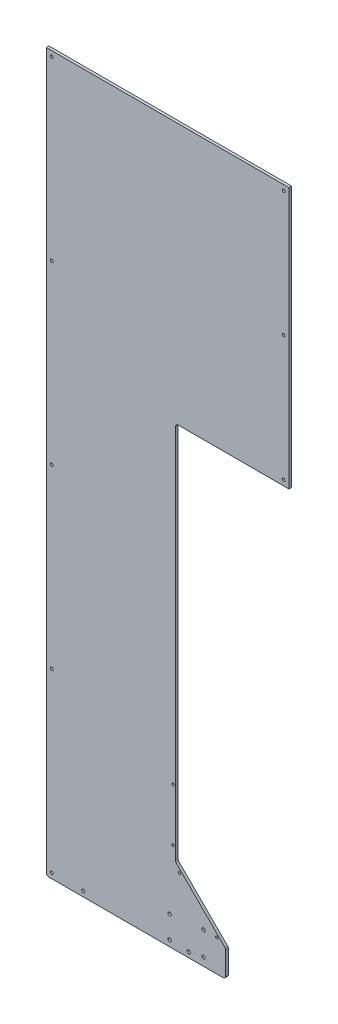
ISO-10303-21;
HEADER;
FILE_DESCRIPTION(('STEP AP214'),'2;1');
FILE_NAME('part.step','',(''),(''),'','','');
FILE_SCHEMA(('AUTOMOTIVE_DESIGN { 1 0 10303 214 1 1 1 1 }'));
ENDSEC;
DATA;
#1=APPLICATION_CONTEXT('core data for automotive mechanical design processes');
#2=APPLICATION_PROTOCOL_DEFINITION('international standard','automotive_design',2000,#1);
#3=PRODUCT_CONTEXT('',#1,'mechanical');
#4=PRODUCT('Part','Part','',(#3));
#5=PRODUCT_RELATED_PRODUCT_CATEGORY('part','',(#4));
#6=PRODUCT_DEFINITION_FORMATION('','',#4);
#7=PRODUCT_DEFINITION_CONTEXT('part definition',#1,'design');
#8=PRODUCT_DEFINITION('design','',#6,#7);
#9=PRODUCT_DEFINITION_SHAPE('','',#8);
#10=(LENGTH_UNIT() NAMED_UNIT(*) SI_UNIT(.MILLI.,.METRE.));
#11=(NAMED_UNIT(*) PLANE_ANGLE_UNIT() SI_UNIT($,.RADIAN.));
#12=(NAMED_UNIT(*) SI_UNIT($,.STERADIAN.) SOLID_ANGLE_UNIT());
#13=UNCERTAINTY_MEASURE_WITH_UNIT(LENGTH_MEASURE(1.E-05),#10,'distance_accuracy_value','');
#14=(GEOMETRIC_REPRESENTATION_CONTEXT(3) GLOBAL_UNCERTAINTY_ASSIGNED_CONTEXT((#13)) GLOBAL_UNIT_ASSIGNED_CONTEXT((#10,
#11,#12)) REPRESENTATION_CONTEXT('',''));
#15=CARTESIAN_POINT('',(0.,0.,0.));
#16=DIRECTION('',(0.,0.,1.));
#17=DIRECTION('',(1.,0.,0.));
#18=AXIS2_PLACEMENT_3D('',#15,#16,#17);
#19=CARTESIAN_POINT('',(0.,0.,6.35));
#20=DIRECTION('',(1.,0.,0.));
#21=DIRECTION('',(0.,0.,-1.));
#22=AXIS2_PLACEMENT_3D('',#19,#20,#21);
#23=PLANE('',#22);
#24=DIRECTION('',(0.,-1.,0.));
#25=VECTOR('',#24,1.);
#26=CARTESIAN_POINT('',(0.,0.,0.));
#27=LINE('',#26,#25);
#28=CARTESIAN_POINT('',(0.,1727.2,0.));
#29=VERTEX_POINT('',#28);
#30=CARTESIAN_POINT('',(0.,6.35,0.));
#31=VERTEX_POINT('',#30);
#32=EDGE_CURVE('E148',#29,#31,#27,.T.);
#33=ORIENTED_EDGE('',*,*,#32,.T.);
#34=DIRECTION('',(0.,0.,-1.));
#35=VECTOR('',#34,1.);
#36=CARTESIAN_POINT('',(0.,6.35,6.35));
#37=LINE('',#36,#35);
#38=CARTESIAN_POINT('',(0.,6.35,6.35));
#39=VERTEX_POINT('',#38);
#40=EDGE_CURVE('E182',#31,#39,#37,.F.);
#41=ORIENTED_EDGE('',*,*,#40,.T.);
#42=DIRECTION('',(0.,-1.,0.));
#43=VECTOR('',#42,1.);
#44=CARTESIAN_POINT('',(0.,0.,6.35));
#45=LINE('',#44,#43);
#46=CARTESIAN_POINT('',(0.,1727.2,6.35));
#47=VERTEX_POINT('',#46);
#48=EDGE_CURVE('E158',#47,#39,#45,.T.);
#49=ORIENTED_EDGE('',*,*,#48,.F.);
#50=DIRECTION('',(0.,0.,-1.));
#51=VECTOR('',#50,1.);
#52=CARTESIAN_POINT('',(0.,1727.2,6.35));
#53=LINE('',#52,#51);
#54=EDGE_CURVE('E164',#47,#29,#53,.T.);
#55=ORIENTED_EDGE('',*,*,#54,.T.);
#56=EDGE_LOOP('',(#33,#41,#49,#55));
#57=FACE_BOUND('',#56,.T.);
#58=ADVANCED_FACE('F35',(#57),#23,.F.);
#59=CARTESIAN_POINT('',(0.,0.,6.35));
#60=DIRECTION('',(0.,1.,0.));
#61=DIRECTION('',(0.,0.,1.));
#62=AXIS2_PLACEMENT_3D('',#59,#60,#61);
#63=PLANE('',#62);
#64=DIRECTION('',(1.,0.,0.));
#65=VECTOR('',#64,1.);
#66=CARTESIAN_POINT('',(0.,0.,6.35));
#67=LINE('',#66,#65);
#68=CARTESIAN_POINT('',(6.35,0.,6.35));
#69=VERTEX_POINT('',#68);
#70=CARTESIAN_POINT('',(425.45,0.,6.35));
#71=VERTEX_POINT('',#70);
#72=EDGE_CURVE('E292',#69,#71,#67,.T.);
#73=ORIENTED_EDGE('',*,*,#72,.F.);
#74=DIRECTION('',(0.,0.,-1.));
#75=VECTOR('',#74,1.);
#76=CARTESIAN_POINT('',(6.35,0.,6.35));
#77=LINE('',#76,#75);
#78=CARTESIAN_POINT('',(6.35,0.,0.));
#79=VERTEX_POINT('',#78);
#80=EDGE_CURVE('E173',#69,#79,#77,.T.);
#81=ORIENTED_EDGE('',*,*,#80,.T.);
#82=DIRECTION('',(1.,0.,0.));
#83=VECTOR('',#82,1.);
#84=CARTESIAN_POINT('',(0.,0.,0.));
#85=LINE('',#84,#83);
#86=CARTESIAN_POINT('',(425.45,0.,0.));
#87=VERTEX_POINT('',#86);
#88=EDGE_CURVE('E156',#79,#87,#85,.T.);
#89=ORIENTED_EDGE('',*,*,#88,.T.);
#90=DIRECTION('',(0.,0.,1.));
#91=VECTOR('',#90,1.);
#92=CARTESIAN_POINT('',(425.45,0.,6.35));
#93=LINE('',#92,#91);
#94=EDGE_CURVE('E170',#87,#71,#93,.T.);
#95=ORIENTED_EDGE('',*,*,#94,.T.);
#96=EDGE_LOOP('',(#73,#81,#89,#95));
#97=FACE_BOUND('',#96,.T.);
#98=ADVANCED_FACE('F308',(#97),#63,.F.);
#99=CARTESIAN_POINT('',(584.2,0.,6.35));
#100=DIRECTION('',(-1.,0.,0.));
#101=DIRECTION('',(0.,0.,1.));
#102=AXIS2_PLACEMENT_3D('',#99,#100,#101);
#103=PLANE('',#102);
#104=DIRECTION('',(0.,1.,0.));
#105=VECTOR('',#104,1.);
#106=CARTESIAN_POINT('',(584.2,0.,6.35));
#107=LINE('',#106,#105);
#108=CARTESIAN_POINT('',(584.2,1098.55,6.35));
#109=VERTEX_POINT('',#108);
#110=CARTESIAN_POINT('',(584.2,1727.2,6.35));
#111=VERTEX_POINT('',#110);
#112=EDGE_CURVE('E147',#109,#111,#107,.T.);
#113=ORIENTED_EDGE('',*,*,#112,.F.);
#114=DIRECTION('',(0.,0.,1.));
#115=VECTOR('',#114,1.);
#116=CARTESIAN_POINT('',(584.2,1098.55,0.));
#117=LINE('',#116,#115);
#118=CARTESIAN_POINT('',(584.2,1098.55,0.));
#119=VERTEX_POINT('',#118);
#120=EDGE_CURVE('E132',#119,#109,#117,.T.);
#121=ORIENTED_EDGE('',*,*,#120,.F.);
#122=DIRECTION('',(0.,1.,0.));
#123=VECTOR('',#122,1.);
#124=CARTESIAN_POINT('',(584.2,0.,0.));
#125=LINE('',#124,#123);
#126=CARTESIAN_POINT('',(584.2,1727.2,0.));
#127=VERTEX_POINT('',#126);
#128=EDGE_CURVE('E145',#119,#127,#125,.T.);
#129=ORIENTED_EDGE('',*,*,#128,.T.);
#130=DIRECTION('',(0.,0.,-1.));
#131=VECTOR('',#130,1.);
#132=CARTESIAN_POINT('',(584.2,1727.2,6.35));
#133=LINE('',#132,#131);
#134=EDGE_CURVE('E167',#111,#127,#133,.T.);
#135=ORIENTED_EDGE('',*,*,#134,.F.);
#136=EDGE_LOOP('',(#113,#121,#129,#135));
#137=FACE_BOUND('',#136,.T.);
#138=ADVANCED_FACE('F143',(#137),#103,.F.);
#139=CARTESIAN_POINT('',(0.,1727.2,6.35));
#140=DIRECTION('',(0.,-1.,0.));
#141=DIRECTION('',(0.,0.,-1.));
#142=AXIS2_PLACEMENT_3D('',#139,#140,#141);
#143=PLANE('',#142);
#144=DIRECTION('',(-1.,0.,0.));
#145=VECTOR('',#144,1.);
#146=CARTESIAN_POINT('',(0.,1727.2,0.));
#147=LINE('',#146,#145);
#148=EDGE_CURVE('E155',#127,#29,#147,.T.);
#149=ORIENTED_EDGE('',*,*,#148,.T.);
#150=ORIENTED_EDGE('',*,*,#54,.F.);
#151=DIRECTION('',(-1.,0.,0.));
#152=VECTOR('',#151,1.);
#153=CARTESIAN_POINT('',(0.,1727.2,6.35));
#154=LINE('',#153,#152);
#155=EDGE_CURVE('E168',#111,#47,#154,.T.);
#156=ORIENTED_EDGE('',*,*,#155,.F.);
#157=ORIENTED_EDGE('',*,*,#134,.T.);
#158=EDGE_LOOP('',(#149,#150,#156,#157));
#159=FACE_BOUND('',#158,.T.);
#160=ADVANCED_FACE('F497',(#159),#143,.F.);
#161=CARTESIAN_POINT('',(0.,0.,6.35));
#162=DIRECTION('',(0.,0.,-1.));
#163=DIRECTION('',(-1.,0.,0.));
#164=AXIS2_PLACEMENT_3D('',#161,#162,#163);
#165=PLANE('',#164);
#166=CARTESIAN_POINT('',(296.8625,68.2625,6.35));
#167=DIRECTION('',(0.,0.,-1.));
#168=DIRECTION('',(-1.,0.,0.));
#169=AXIS2_PLACEMENT_3D('',#166,#167,#168);
#170=CIRCLE('',#169,3.96875000000002);
#171=CARTESIAN_POINT('',(292.89375,68.2625,6.35));
#172=VERTEX_POINT('',#171);
#173=EDGE_CURVE('E721',#172,#172,#170,.T.);
#174=ORIENTED_EDGE('',*,*,#173,.T.);
#175=EDGE_LOOP('',(#174));
#176=FACE_BOUND('',#175,.T.);
#177=CARTESIAN_POINT('',(296.8625,14.2875,6.35));
#178=DIRECTION('',(0.,0.,-1.));
#179=DIRECTION('',(-1.,0.,0.));
#180=AXIS2_PLACEMENT_3D('',#177,#178,#179);
#181=CIRCLE('',#180,3.96875000000002);
#182=CARTESIAN_POINT('',(292.89375,14.2875,6.35));
#183=VERTEX_POINT('',#182);
#184=EDGE_CURVE('E731',#183,#183,#181,.T.);
#185=ORIENTED_EDGE('',*,*,#184,.T.);
#186=EDGE_LOOP('',(#185));
#187=FACE_BOUND('',#186,.T.);
#188=CARTESIAN_POINT('',(378.46762,19.0499999999997,6.35));
#189=DIRECTION('',(0.,0.,1.));
#190=DIRECTION('',(1.,0.,0.));
#191=AXIS2_PLACEMENT_3D('',#188,#189,#190);
#192=CIRCLE('',#191,3.937);
#193=CARTESIAN_POINT('',(382.40462,19.0499999999997,6.35));
#194=VERTEX_POINT('',#193);
#195=EDGE_CURVE('E739',#194,#194,#192,.T.);
#196=ORIENTED_EDGE('',*,*,#195,.F.);
#197=EDGE_LOOP('',(#196));
#198=FACE_BOUND('',#197,.T.);
#199=CARTESIAN_POINT('',(378.46762,76.1999999999997,6.35));
#200=DIRECTION('',(0.,0.,1.));
#201=DIRECTION('',(1.,0.,0.));
#202=AXIS2_PLACEMENT_3D('',#199,#200,#201);
#203=CIRCLE('',#202,3.937);
#204=CARTESIAN_POINT('',(382.40462,76.1999999999997,6.35));
#205=VERTEX_POINT('',#204);
#206=EDGE_CURVE('E734',#205,#205,#203,.T.);
#207=ORIENTED_EDGE('',*,*,#206,.F.);
#208=EDGE_LOOP('',(#207));
#209=FACE_BOUND('',#208,.T.);
#210=CARTESIAN_POINT('',(304.8,342.9,6.35));
#211=DIRECTION('',(0.,0.,-1.));
#212=DIRECTION('',(-1.,0.,0.));
#213=AXIS2_PLACEMENT_3D('',#210,#211,#212);
#214=CIRCLE('',#213,2.8067);
#215=CARTESIAN_POINT('',(301.9933,342.9,6.35));
#216=VERTEX_POINT('',#215);
#217=EDGE_CURVE('E752',#216,#216,#214,.T.);
#218=ORIENTED_EDGE('',*,*,#217,.T.);
#219=EDGE_LOOP('',(#218));
#220=FACE_BOUND('',#219,.T.);
#221=CARTESIAN_POINT('',(304.8,215.9,6.35));
#222=DIRECTION('',(0.,0.,-1.));
#223=DIRECTION('',(-1.,0.,0.));
#224=AXIS2_PLACEMENT_3D('',#221,#222,#223);
#225=CIRCLE('',#224,2.8067);
#226=CARTESIAN_POINT('',(301.9933,215.9,6.35));
#227=VERTEX_POINT('',#226);
#228=EDGE_CURVE('E761',#227,#227,#225,.T.);
#229=ORIENTED_EDGE('',*,*,#228,.T.);
#230=EDGE_LOOP('',(#229));
#231=FACE_BOUND('',#230,.T.);
#232=CARTESIAN_POINT('',(320.317182668239,166.002561210692,6.35));
#233=DIRECTION('',(0.,0.,-1.));
#234=DIRECTION('',(-1.,0.,0.));
#235=AXIS2_PLACEMENT_3D('',#232,#233,#234);
#236=CIRCLE('',#235,2.8067);
#237=CARTESIAN_POINT('',(317.510482668239,166.002561210692,6.35));
#238=VERTEX_POINT('',#237);
#239=EDGE_CURVE('E770',#238,#238,#236,.T.);
#240=ORIENTED_EDGE('',*,*,#239,.T.);
#241=EDGE_LOOP('',(#240));
#242=FACE_BOUND('',#241,.T.);
#243=CARTESIAN_POINT('',(410.11974387893,76.2,6.35));
#244=DIRECTION('',(0.,0.,-1.));
#245=DIRECTION('',(-1.,0.,0.));
#246=AXIS2_PLACEMENT_3D('',#243,#244,#245);
#247=CIRCLE('',#246,2.8067);
#248=CARTESIAN_POINT('',(407.31304387893,76.2,6.35));
#249=VERTEX_POINT('',#248);
#250=EDGE_CURVE('E222',#249,#249,#247,.T.);
#251=ORIENTED_EDGE('',*,*,#250,.T.);
#252=EDGE_LOOP('',(#251));
#253=FACE_BOUND('',#252,.T.);
#254=CARTESIAN_POINT('',(88.9,12.7,6.35));
#255=DIRECTION('',(0.,0.,1.));
#256=DIRECTION('',(1.,0.,0.));
#257=AXIS2_PLACEMENT_3D('',#254,#255,#256);
#258=CIRCLE('',#257,3.96875);
#259=CARTESIAN_POINT('',(92.86875,12.7,6.35));
#260=VERTEX_POINT('',#259);
#261=EDGE_CURVE('E211',#260,#260,#258,.T.);
#262=ORIENTED_EDGE('',*,*,#261,.F.);
#263=EDGE_LOOP('',(#262));
#264=FACE_BOUND('',#263,.T.);
#265=CARTESIAN_POINT('',(342.9,12.7,6.35));
#266=DIRECTION('',(0.,0.,1.));
#267=DIRECTION('',(1.,0.,0.));
#268=AXIS2_PLACEMENT_3D('',#265,#266,#267);
#269=CIRCLE('',#268,3.96875000000005);
#270=CARTESIAN_POINT('',(346.86875,12.7,6.35));
#271=VERTEX_POINT('',#270);
#272=EDGE_CURVE('E217',#271,#271,#269,.T.);
#273=ORIENTED_EDGE('',*,*,#272,.F.);
#274=EDGE_LOOP('',(#273));
#275=FACE_BOUND('',#274,.T.);
#276=CARTESIAN_POINT('',(12.7,1714.5,6.35));
#277=DIRECTION('',(0.,0.,1.));
#278=DIRECTION('',(1.,0.,0.));
#279=AXIS2_PLACEMENT_3D('',#276,#277,#278);
#280=CIRCLE('',#279,3.37819999999999);
#281=CARTESIAN_POINT('',(16.0782,1714.5,6.35));
#282=VERTEX_POINT('',#281);
#283=EDGE_CURVE('E215',#282,#282,#280,.T.);
#284=ORIENTED_EDGE('',*,*,#283,.F.);
#285=EDGE_LOOP('',(#284));
#286=FACE_BOUND('',#285,.T.);
#287=CARTESIAN_POINT('',(12.7,1289.05,6.35));
#288=DIRECTION('',(0.,0.,1.));
#289=DIRECTION('',(1.,0.,0.));
#290=AXIS2_PLACEMENT_3D('',#287,#288,#289);
#291=CIRCLE('',#290,3.37819999999999);
#292=CARTESIAN_POINT('',(16.0782,1289.05,6.35));
#293=VERTEX_POINT('',#292);
#294=EDGE_CURVE('E232',#293,#293,#291,.T.);
#295=ORIENTED_EDGE('',*,*,#294,.F.);
#296=EDGE_LOOP('',(#295));
#297=FACE_BOUND('',#296,.T.);
#298=CARTESIAN_POINT('',(12.7,863.6,6.35));
#299=DIRECTION('',(0.,0.,1.));
#300=DIRECTION('',(1.,0.,0.));
#301=AXIS2_PLACEMENT_3D('',#298,#299,#300);
#302=CIRCLE('',#301,3.37819999999999);
#303=CARTESIAN_POINT('',(16.0782,863.6,6.35));
#304=VERTEX_POINT('',#303);
#305=EDGE_CURVE('E238',#304,#304,#302,.T.);
#306=ORIENTED_EDGE('',*,*,#305,.F.);
#307=EDGE_LOOP('',(#306));
#308=FACE_BOUND('',#307,.T.);
#309=CARTESIAN_POINT('',(12.7,438.15,6.35));
#310=DIRECTION('',(0.,0.,1.));
#311=DIRECTION('',(1.,0.,0.));
#312=AXIS2_PLACEMENT_3D('',#309,#310,#311);
#313=CIRCLE('',#312,3.37819999999999);
#314=CARTESIAN_POINT('',(16.0782,438.15,6.35));
#315=VERTEX_POINT('',#314);
#316=EDGE_CURVE('E244',#315,#315,#313,.T.);
#317=ORIENTED_EDGE('',*,*,#316,.F.);
#318=EDGE_LOOP('',(#317));
#319=FACE_BOUND('',#318,.T.);
#320=CARTESIAN_POINT('',(12.7,12.7,6.35));
#321=DIRECTION('',(0.,0.,1.));
#322=DIRECTION('',(1.,0.,0.));
#323=AXIS2_PLACEMENT_3D('',#320,#321,#322);
#324=CIRCLE('',#323,3.37819999999999);
#325=CARTESIAN_POINT('',(16.0782,12.7,6.35));
#326=VERTEX_POINT('',#325);
#327=EDGE_CURVE('E250',#326,#326,#324,.T.);
#328=ORIENTED_EDGE('',*,*,#327,.F.);
#329=EDGE_LOOP('',(#328));
#330=FACE_BOUND('',#329,.T.);
#331=CARTESIAN_POINT('',(571.5,1111.25,6.35));
#332=DIRECTION('',(0.,0.,1.));
#333=DIRECTION('',(1.,0.,0.));
#334=AXIS2_PLACEMENT_3D('',#331,#332,#333);
#335=CIRCLE('',#334,3.3782);
#336=CARTESIAN_POINT('',(574.8782,1111.25,6.35));
#337=VERTEX_POINT('',#336);
#338=EDGE_CURVE('E256',#337,#337,#335,.T.);
#339=ORIENTED_EDGE('',*,*,#338,.F.);
#340=EDGE_LOOP('',(#339));
#341=FACE_BOUND('',#340,.T.);
#342=CARTESIAN_POINT('',(571.5,1412.875,6.35));
#343=DIRECTION('',(0.,0.,1.));
#344=DIRECTION('',(1.,0.,0.));
#345=AXIS2_PLACEMENT_3D('',#342,#343,#344);
#346=CIRCLE('',#345,3.3782);
#347=CARTESIAN_POINT('',(574.8782,1412.875,6.35));
#348=VERTEX_POINT('',#347);
#349=EDGE_CURVE('E262',#348,#348,#346,.T.);
#350=ORIENTED_EDGE('',*,*,#349,.F.);
#351=EDGE_LOOP('',(#350));
#352=FACE_BOUND('',#351,.T.);
#353=CARTESIAN_POINT('',(571.5,1714.5,6.35));
#354=DIRECTION('',(0.,0.,1.));
#355=DIRECTION('',(1.,0.,0.));
#356=AXIS2_PLACEMENT_3D('',#353,#354,#355);
#357=CIRCLE('',#356,3.3782);
#358=CARTESIAN_POINT('',(574.8782,1714.5,6.35));
#359=VERTEX_POINT('',#358);
#360=EDGE_CURVE('E268',#359,#359,#357,.T.);
#361=ORIENTED_EDGE('',*,*,#360,.F.);
#362=EDGE_LOOP('',(#361));
#363=FACE_BOUND('',#362,.T.);
#364=ORIENTED_EDGE('',*,*,#48,.T.);
#365=CARTESIAN_POINT('',(6.35,6.35,6.35));
#366=DIRECTION('',(0.,0.,-1.));
#367=DIRECTION('',(-1.,0.,0.));
#368=AXIS2_PLACEMENT_3D('',#365,#366,#367);
#369=CIRCLE('',#368,6.35);
#370=EDGE_CURVE('E188',#39,#69,#369,.F.);
#371=ORIENTED_EDGE('',*,*,#370,.T.);
#372=ORIENTED_EDGE('',*,*,#72,.T.);
#373=CARTESIAN_POINT('',(425.45,6.35,6.35));
#374=DIRECTION('',(0.,0.,-1.));
#375=DIRECTION('',(-1.,0.,0.));
#376=AXIS2_PLACEMENT_3D('',#373,#374,#375);
#377=CIRCLE('',#376,6.35);
#378=CARTESIAN_POINT('',(431.8,6.35,6.35));
#379=VERTEX_POINT('',#378);
#380=EDGE_CURVE('E186',#71,#379,#377,.F.);
#381=ORIENTED_EDGE('',*,*,#380,.T.);
#382=DIRECTION('',(0.,-1.,0.));
#383=VECTOR('',#382,1.);
#384=CARTESIAN_POINT('',(431.8,63.5,6.35));
#385=LINE('',#384,#383);
#386=CARTESIAN_POINT('',(431.8,60.8697438789308,6.35));
#387=VERTEX_POINT('',#386);
#388=EDGE_CURVE('E139',#387,#379,#385,.T.);
#389=ORIENTED_EDGE('',*,*,#388,.F.);
#390=CARTESIAN_POINT('',(425.45,60.8697438789308,6.35));
#391=DIRECTION('',(0.,0.,-1.));
#392=DIRECTION('',(-1.,0.,0.));
#393=AXIS2_PLACEMENT_3D('',#390,#391,#392);
#394=CIRCLE('',#393,6.35);
#395=CARTESIAN_POINT('',(429.940128060535,65.3598719394654,6.35));
#396=VERTEX_POINT('',#395);
#397=EDGE_CURVE('E184',#387,#396,#394,.F.);
#398=ORIENTED_EDGE('',*,*,#397,.T.);
#399=DIRECTION('',(0.70710678118655,-0.707106781186545,0.));
#400=VECTOR('',#399,1.);
#401=CARTESIAN_POINT('',(311.15,184.149999999999,6.35));
#402=LINE('',#401,#400);
#403=CARTESIAN_POINT('',(313.009871939466,182.290128060534,6.35));
#404=VERTEX_POINT('',#403);
#405=EDGE_CURVE('E285',#404,#396,#402,.T.);
#406=ORIENTED_EDGE('',*,*,#405,.F.);
#407=CARTESIAN_POINT('',(317.5,186.780256121068,6.35));
#408=DIRECTION('',(0.,0.,-1.));
#409=DIRECTION('',(-1.,0.,0.));
#410=AXIS2_PLACEMENT_3D('',#407,#408,#409);
#411=CIRCLE('',#410,6.35);
#412=CARTESIAN_POINT('',(311.15,186.780256121068,6.35));
#413=VERTEX_POINT('',#412);
#414=EDGE_CURVE('E57',#404,#413,#411,.T.);
#415=ORIENTED_EDGE('',*,*,#414,.T.);
#416=DIRECTION('',(0.,-1.,0.));
#417=VECTOR('',#416,1.);
#418=CARTESIAN_POINT('',(311.15,1098.55,6.35));
#419=LINE('',#418,#417);
#420=CARTESIAN_POINT('',(311.15,1092.2,6.35));
#421=VERTEX_POINT('',#420);
#422=EDGE_CURVE('E283',#421,#413,#419,.T.);
#423=ORIENTED_EDGE('',*,*,#422,.F.);
#424=CARTESIAN_POINT('',(317.5,1092.2,6.35));
#425=DIRECTION('',(0.,0.,-1.));
#426=DIRECTION('',(-1.,0.,0.));
#427=AXIS2_PLACEMENT_3D('',#424,#425,#426);
#428=CIRCLE('',#427,6.35);
#429=CARTESIAN_POINT('',(317.5,1098.55,6.35));
#430=VERTEX_POINT('',#429);
#431=EDGE_CURVE('E44',#421,#430,#428,.T.);
#432=ORIENTED_EDGE('',*,*,#431,.T.);
#433=DIRECTION('',(-1.,0.,0.));
#434=VECTOR('',#433,1.);
#435=CARTESIAN_POINT('',(584.2,1098.55,6.35));
#436=LINE('',#435,#434);
#437=EDGE_CURVE('E273',#109,#430,#436,.T.);
#438=ORIENTED_EDGE('',*,*,#437,.F.);
#439=ORIENTED_EDGE('',*,*,#112,.T.);
#440=ORIENTED_EDGE('',*,*,#155,.T.);
#441=EDGE_LOOP('',(#364,#371,#372,#381,#389,#398,#406,#415,#423,#432,#438,#439,#440));
#442=FACE_BOUND('',#441,.T.);
#443=ADVANCED_FACE('F306',(#176,#187,#198,#209,#220,#231,#242,#253,#264,#275,#286,#297,#308,
#319,#330,#341,#352,#363,#442),#165,.F.);
#444=CARTESIAN_POINT('',(0.,0.,0.));
#445=DIRECTION('',(0.,0.,-1.));
#446=DIRECTION('',(-1.,0.,0.));
#447=AXIS2_PLACEMENT_3D('',#444,#445,#446);
#448=PLANE('',#447);
#449=CARTESIAN_POINT('',(296.8625,68.2625,0.));
#450=DIRECTION('',(0.,0.,-1.));
#451=DIRECTION('',(-1.,0.,0.));
#452=AXIS2_PLACEMENT_3D('',#449,#450,#451);
#453=CIRCLE('',#452,3.96875000000002);
#454=CARTESIAN_POINT('',(292.89375,68.2625,0.));
#455=VERTEX_POINT('',#454);
#456=EDGE_CURVE('E724',#455,#455,#453,.T.);
#457=ORIENTED_EDGE('',*,*,#456,.F.);
#458=EDGE_LOOP('',(#457));
#459=FACE_BOUND('',#458,.T.);
#460=CARTESIAN_POINT('',(296.8625,14.2875,0.));
#461=DIRECTION('',(0.,0.,-1.));
#462=DIRECTION('',(-1.,0.,0.));
#463=AXIS2_PLACEMENT_3D('',#460,#461,#462);
#464=CIRCLE('',#463,3.96875000000002);
#465=CARTESIAN_POINT('',(292.89375,14.2875,0.));
#466=VERTEX_POINT('',#465);
#467=EDGE_CURVE('E726',#466,#466,#464,.T.);
#468=ORIENTED_EDGE('',*,*,#467,.F.);
#469=EDGE_LOOP('',(#468));
#470=FACE_BOUND('',#469,.T.);
#471=CARTESIAN_POINT('',(378.46762,19.0499999999997,0.));
#472=DIRECTION('',(0.,0.,1.));
#473=DIRECTION('',(1.,0.,0.));
#474=AXIS2_PLACEMENT_3D('',#471,#472,#473);
#475=CIRCLE('',#474,3.937);
#476=CARTESIAN_POINT('',(382.40462,19.0499999999997,0.));
#477=VERTEX_POINT('',#476);
#478=EDGE_CURVE('E735',#477,#477,#475,.T.);
#479=ORIENTED_EDGE('',*,*,#478,.T.);
#480=EDGE_LOOP('',(#479));
#481=FACE_BOUND('',#480,.T.);
#482=CARTESIAN_POINT('',(378.46762,76.1999999999997,0.));
#483=DIRECTION('',(0.,0.,1.));
#484=DIRECTION('',(1.,0.,0.));
#485=AXIS2_PLACEMENT_3D('',#482,#483,#484);
#486=CIRCLE('',#485,3.937);
#487=CARTESIAN_POINT('',(382.40462,76.1999999999997,0.));
#488=VERTEX_POINT('',#487);
#489=EDGE_CURVE('E742',#488,#488,#486,.T.);
#490=ORIENTED_EDGE('',*,*,#489,.T.);
#491=EDGE_LOOP('',(#490));
#492=FACE_BOUND('',#491,.T.);
#493=CARTESIAN_POINT('',(304.8,342.9,0.));
#494=DIRECTION('',(0.,0.,-1.));
#495=DIRECTION('',(-1.,0.,0.));
#496=AXIS2_PLACEMENT_3D('',#493,#494,#495);
#497=CIRCLE('',#496,4.88949999999999);
#498=CARTESIAN_POINT('',(299.9105,342.9,0.));
#499=VERTEX_POINT('',#498);
#500=EDGE_CURVE('E738',#499,#499,#497,.T.);
#501=ORIENTED_EDGE('',*,*,#500,.F.);
#502=EDGE_LOOP('',(#501));
#503=FACE_BOUND('',#502,.T.);
#504=CARTESIAN_POINT('',(304.8,215.9,0.));
#505=DIRECTION('',(0.,0.,-1.));
#506=DIRECTION('',(-1.,0.,0.));
#507=AXIS2_PLACEMENT_3D('',#504,#505,#506);
#508=CIRCLE('',#507,4.88949999999999);
#509=CARTESIAN_POINT('',(299.9105,215.9,0.));
#510=VERTEX_POINT('',#509);
#511=EDGE_CURVE('E755',#510,#510,#508,.T.);
#512=ORIENTED_EDGE('',*,*,#511,.F.);
#513=EDGE_LOOP('',(#512));
#514=FACE_BOUND('',#513,.T.);
#515=CARTESIAN_POINT('',(320.317182668239,166.002561210692,0.));
#516=DIRECTION('',(0.,0.,-1.));
#517=DIRECTION('',(-1.,0.,0.));
#518=AXIS2_PLACEMENT_3D('',#515,#516,#517);
#519=CIRCLE('',#518,4.88949999999999);
#520=CARTESIAN_POINT('',(315.427682668239,166.002561210692,0.));
#521=VERTEX_POINT('',#520);
#522=EDGE_CURVE('E764',#521,#521,#519,.T.);
#523=ORIENTED_EDGE('',*,*,#522,.F.);
#524=EDGE_LOOP('',(#523));
#525=FACE_BOUND('',#524,.T.);
#526=CARTESIAN_POINT('',(410.11974387893,76.2,0.));
#527=DIRECTION('',(0.,0.,-1.));
#528=DIRECTION('',(-1.,0.,0.));
#529=AXIS2_PLACEMENT_3D('',#526,#527,#528);
#530=CIRCLE('',#529,4.88949999999999);
#531=CARTESIAN_POINT('',(405.23024387893,76.2,0.));
#532=VERTEX_POINT('',#531);
#533=EDGE_CURVE('E773',#532,#532,#530,.T.);
#534=ORIENTED_EDGE('',*,*,#533,.F.);
#535=EDGE_LOOP('',(#534));
#536=FACE_BOUND('',#535,.T.);
#537=CARTESIAN_POINT('',(88.9,12.7,0.));
#538=DIRECTION('',(0.,0.,-1.));
#539=DIRECTION('',(-1.,0.,0.));
#540=AXIS2_PLACEMENT_3D('',#537,#538,#539);
#541=CIRCLE('',#540,3.96875);
#542=CARTESIAN_POINT('',(84.93125,12.7,0.));
#543=VERTEX_POINT('',#542);
#544=EDGE_CURVE('E39',#543,#543,#541,.T.);
#545=ORIENTED_EDGE('',*,*,#544,.F.);
#546=EDGE_LOOP('',(#545));
#547=FACE_BOUND('',#546,.T.);
#548=CARTESIAN_POINT('',(342.9,12.7,0.));
#549=DIRECTION('',(0.,0.,-1.));
#550=DIRECTION('',(-1.,0.,0.));
#551=AXIS2_PLACEMENT_3D('',#548,#549,#550);
#552=CIRCLE('',#551,3.96875000000005);
#553=CARTESIAN_POINT('',(338.93125,12.7,0.));
#554=VERTEX_POINT('',#553);
#555=EDGE_CURVE('E209',#554,#554,#552,.T.);
#556=ORIENTED_EDGE('',*,*,#555,.F.);
#557=EDGE_LOOP('',(#556));
#558=FACE_BOUND('',#557,.T.);
#559=CARTESIAN_POINT('',(12.7,1714.5,0.));
#560=DIRECTION('',(0.,0.,1.));
#561=DIRECTION('',(1.,0.,0.));
#562=AXIS2_PLACEMENT_3D('',#559,#560,#561);
#563=CIRCLE('',#562,3.37819999999999);
#564=CARTESIAN_POINT('',(16.0782,1714.5,0.));
#565=VERTEX_POINT('',#564);
#566=EDGE_CURVE('E229',#565,#565,#563,.T.);
#567=ORIENTED_EDGE('',*,*,#566,.T.);
#568=EDGE_LOOP('',(#567));
#569=FACE_BOUND('',#568,.T.);
#570=CARTESIAN_POINT('',(12.7,1289.05,0.));
#571=DIRECTION('',(0.,0.,1.));
#572=DIRECTION('',(1.,0.,0.));
#573=AXIS2_PLACEMENT_3D('',#570,#571,#572);
#574=CIRCLE('',#573,3.37819999999999);
#575=CARTESIAN_POINT('',(16.0782,1289.05,0.));
#576=VERTEX_POINT('',#575);
#577=EDGE_CURVE('E235',#576,#576,#574,.T.);
#578=ORIENTED_EDGE('',*,*,#577,.T.);
#579=EDGE_LOOP('',(#578));
#580=FACE_BOUND('',#579,.T.);
#581=CARTESIAN_POINT('',(12.7,863.6,0.));
#582=DIRECTION('',(0.,0.,1.));
#583=DIRECTION('',(1.,0.,0.));
#584=AXIS2_PLACEMENT_3D('',#581,#582,#583);
#585=CIRCLE('',#584,3.37819999999999);
#586=CARTESIAN_POINT('',(16.0782,863.6,0.));
#587=VERTEX_POINT('',#586);
#588=EDGE_CURVE('E241',#587,#587,#585,.T.);
#589=ORIENTED_EDGE('',*,*,#588,.T.);
#590=EDGE_LOOP('',(#589));
#591=FACE_BOUND('',#590,.T.);
#592=CARTESIAN_POINT('',(12.7,438.15,0.));
#593=DIRECTION('',(0.,0.,1.));
#594=DIRECTION('',(1.,0.,0.));
#595=AXIS2_PLACEMENT_3D('',#592,#593,#594);
#596=CIRCLE('',#595,3.37819999999999);
#597=CARTESIAN_POINT('',(16.0782,438.15,0.));
#598=VERTEX_POINT('',#597);
#599=EDGE_CURVE('E247',#598,#598,#596,.T.);
#600=ORIENTED_EDGE('',*,*,#599,.T.);
#601=EDGE_LOOP('',(#600));
#602=FACE_BOUND('',#601,.T.);
#603=CARTESIAN_POINT('',(12.7,12.7,0.));
#604=DIRECTION('',(0.,0.,1.));
#605=DIRECTION('',(1.,0.,0.));
#606=AXIS2_PLACEMENT_3D('',#603,#604,#605);
#607=CIRCLE('',#606,3.37819999999999);
#608=CARTESIAN_POINT('',(16.0782,12.7,0.));
#609=VERTEX_POINT('',#608);
#610=EDGE_CURVE('E253',#609,#609,#607,.T.);
#611=ORIENTED_EDGE('',*,*,#610,.T.);
#612=EDGE_LOOP('',(#611));
#613=FACE_BOUND('',#612,.T.);
#614=CARTESIAN_POINT('',(571.5,1111.25,0.));
#615=DIRECTION('',(0.,0.,1.));
#616=DIRECTION('',(1.,0.,0.));
#617=AXIS2_PLACEMENT_3D('',#614,#615,#616);
#618=CIRCLE('',#617,3.3782);
#619=CARTESIAN_POINT('',(574.8782,1111.25,0.));
#620=VERTEX_POINT('',#619);
#621=EDGE_CURVE('E259',#620,#620,#618,.T.);
#622=ORIENTED_EDGE('',*,*,#621,.T.);
#623=EDGE_LOOP('',(#622));
#624=FACE_BOUND('',#623,.T.);
#625=CARTESIAN_POINT('',(571.5,1412.875,0.));
#626=DIRECTION('',(0.,0.,1.));
#627=DIRECTION('',(1.,0.,0.));
#628=AXIS2_PLACEMENT_3D('',#625,#626,#627);
#629=CIRCLE('',#628,3.3782);
#630=CARTESIAN_POINT('',(574.8782,1412.875,0.));
#631=VERTEX_POINT('',#630);
#632=EDGE_CURVE('E265',#631,#631,#629,.T.);
#633=ORIENTED_EDGE('',*,*,#632,.T.);
#634=EDGE_LOOP('',(#633));
#635=FACE_BOUND('',#634,.T.);
#636=CARTESIAN_POINT('',(571.5,1714.5,0.));
#637=DIRECTION('',(0.,0.,1.));
#638=DIRECTION('',(1.,0.,0.));
#639=AXIS2_PLACEMENT_3D('',#636,#637,#638);
#640=CIRCLE('',#639,3.3782);
#641=CARTESIAN_POINT('',(574.8782,1714.5,0.));
#642=VERTEX_POINT('',#641);
#643=EDGE_CURVE('E271',#642,#642,#640,.T.);
#644=ORIENTED_EDGE('',*,*,#643,.T.);
#645=EDGE_LOOP('',(#644));
#646=FACE_BOUND('',#645,.T.);
#647=ORIENTED_EDGE('',*,*,#88,.F.);
#648=CARTESIAN_POINT('',(6.35,6.35,0.));
#649=DIRECTION('',(0.,0.,-1.));
#650=DIRECTION('',(-1.,0.,0.));
#651=AXIS2_PLACEMENT_3D('',#648,#649,#650);
#652=CIRCLE('',#651,6.35);
#653=EDGE_CURVE('E180',#79,#31,#652,.T.);
#654=ORIENTED_EDGE('',*,*,#653,.T.);
#655=ORIENTED_EDGE('',*,*,#32,.F.);
#656=ORIENTED_EDGE('',*,*,#148,.F.);
#657=ORIENTED_EDGE('',*,*,#128,.F.);
#658=DIRECTION('',(-1.,0.,0.));
#659=VECTOR('',#658,1.);
#660=CARTESIAN_POINT('',(584.2,1098.55,0.));
#661=LINE('',#660,#659);
#662=CARTESIAN_POINT('',(317.5,1098.55,0.));
#663=VERTEX_POINT('',#662);
#664=EDGE_CURVE('E129',#119,#663,#661,.T.);
#665=ORIENTED_EDGE('',*,*,#664,.T.);
#666=CARTESIAN_POINT('',(317.5,1092.2,0.));
#667=DIRECTION('',(0.,0.,-1.));
#668=DIRECTION('',(-1.,0.,0.));
#669=AXIS2_PLACEMENT_3D('',#666,#667,#668);
#670=CIRCLE('',#669,6.35);
#671=CARTESIAN_POINT('',(311.15,1092.2,0.));
#672=VERTEX_POINT('',#671);
#673=EDGE_CURVE('E11',#663,#672,#670,.F.);
#674=ORIENTED_EDGE('',*,*,#673,.T.);
#675=DIRECTION('',(0.,-1.,0.));
#676=VECTOR('',#675,1.);
#677=CARTESIAN_POINT('',(311.15,1098.55,0.));
#678=LINE('',#677,#676);
#679=CARTESIAN_POINT('',(311.15,186.780256121068,0.));
#680=VERTEX_POINT('',#679);
#681=EDGE_CURVE('E138',#672,#680,#678,.T.);
#682=ORIENTED_EDGE('',*,*,#681,.T.);
#683=CARTESIAN_POINT('',(317.5,186.780256121068,0.));
#684=DIRECTION('',(0.,0.,-1.));
#685=DIRECTION('',(-1.,0.,0.));
#686=AXIS2_PLACEMENT_3D('',#683,#684,#685);
#687=CIRCLE('',#686,6.35);
#688=CARTESIAN_POINT('',(313.009871939466,182.290128060534,0.));
#689=VERTEX_POINT('',#688);
#690=EDGE_CURVE('E207',#680,#689,#687,.F.);
#691=ORIENTED_EDGE('',*,*,#690,.T.);
#692=DIRECTION('',(0.70710678118655,-0.707106781186545,0.));
#693=VECTOR('',#692,1.);
#694=CARTESIAN_POINT('',(311.15,184.149999999999,0.));
#695=LINE('',#694,#693);
#696=CARTESIAN_POINT('',(429.940128060535,65.3598719394654,0.));
#697=VERTEX_POINT('',#696);
#698=EDGE_CURVE('E277',#689,#697,#695,.T.);
#699=ORIENTED_EDGE('',*,*,#698,.T.);
#700=CARTESIAN_POINT('',(425.45,60.8697438789308,0.));
#701=DIRECTION('',(0.,0.,-1.));
#702=DIRECTION('',(-1.,0.,0.));
#703=AXIS2_PLACEMENT_3D('',#700,#701,#702);
#704=CIRCLE('',#703,6.35);
#705=CARTESIAN_POINT('',(431.8,60.8697438789308,0.));
#706=VERTEX_POINT('',#705);
#707=EDGE_CURVE('E176',#697,#706,#704,.T.);
#708=ORIENTED_EDGE('',*,*,#707,.T.);
#709=DIRECTION('',(0.,-1.,0.));
#710=VECTOR('',#709,1.);
#711=CARTESIAN_POINT('',(431.8,63.5,0.));
#712=LINE('',#711,#710);
#713=CARTESIAN_POINT('',(431.8,6.35,0.));
#714=VERTEX_POINT('',#713);
#715=EDGE_CURVE('E149',#706,#714,#712,.T.);
#716=ORIENTED_EDGE('',*,*,#715,.T.);
#717=CARTESIAN_POINT('',(425.45,6.35,0.));
#718=DIRECTION('',(0.,0.,-1.));
#719=DIRECTION('',(-1.,0.,0.));
#720=AXIS2_PLACEMENT_3D('',#717,#718,#719);
#721=CIRCLE('',#720,6.35);
#722=EDGE_CURVE('E178',#714,#87,#721,.T.);
#723=ORIENTED_EDGE('',*,*,#722,.T.);
#724=EDGE_LOOP('',(#647,#654,#655,#656,#657,#665,#674,#682,#691,#699,#708,#716,#723));
#725=FACE_BOUND('',#724,.T.);
#726=ADVANCED_FACE('F153',(#459,#470,#481,#492,#503,#514,#525,#536,#547,#558,#569,#580,#591,
#602,#613,#624,#635,#646,#725),#448,.T.);
#727=CARTESIAN_POINT('',(431.8,63.5,0.));
#728=DIRECTION('',(-1.,0.,0.));
#729=DIRECTION('',(0.,0.,1.));
#730=AXIS2_PLACEMENT_3D('',#727,#728,#729);
#731=PLANE('',#730);
#732=ORIENTED_EDGE('',*,*,#388,.T.);
#733=DIRECTION('',(0.,0.,1.));
#734=VECTOR('',#733,1.);
#735=CARTESIAN_POINT('',(431.8,6.35,0.));
#736=LINE('',#735,#734);
#737=EDGE_CURVE('E193',#379,#714,#736,.F.);
#738=ORIENTED_EDGE('',*,*,#737,.T.);
#739=ORIENTED_EDGE('',*,*,#715,.F.);
#740=DIRECTION('',(0.,0.,1.));
#741=VECTOR('',#740,1.);
#742=CARTESIAN_POINT('',(431.8,60.8697438789308,0.));
#743=LINE('',#742,#741);
#744=EDGE_CURVE('E190',#706,#387,#743,.T.);
#745=ORIENTED_EDGE('',*,*,#744,.T.);
#746=EDGE_LOOP('',(#732,#738,#739,#745));
#747=FACE_BOUND('',#746,.T.);
#748=ADVANCED_FACE('F316',(#747),#731,.F.);
#749=CARTESIAN_POINT('',(311.15,184.149999999999,0.));
#750=DIRECTION('',(-0.707106781186545,-0.707106781186549,0.));
#751=DIRECTION('',(0.70710678118655,-0.707106781186545,0.));
#752=AXIS2_PLACEMENT_3D('',#749,#750,#751);
#753=PLANE('',#752);
#754=ORIENTED_EDGE('',*,*,#405,.T.);
#755=DIRECTION('',(0.,0.,1.));
#756=VECTOR('',#755,1.);
#757=CARTESIAN_POINT('',(429.940128060535,65.3598719394654,0.));
#758=LINE('',#757,#756);
#759=EDGE_CURVE('E198',#396,#697,#758,.F.);
#760=ORIENTED_EDGE('',*,*,#759,.T.);
#761=ORIENTED_EDGE('',*,*,#698,.F.);
#762=DIRECTION('',(0.,0.,1.));
#763=VECTOR('',#762,1.);
#764=CARTESIAN_POINT('',(313.009871939466,182.290128060534,6.35));
#765=LINE('',#764,#763);
#766=EDGE_CURVE('E195',#689,#404,#765,.T.);
#767=ORIENTED_EDGE('',*,*,#766,.T.);
#768=EDGE_LOOP('',(#754,#760,#761,#767));
#769=FACE_BOUND('',#768,.T.);
#770=ADVANCED_FACE('F324',(#769),#753,.F.);
#771=CARTESIAN_POINT('',(311.15,1098.55,0.));
#772=DIRECTION('',(-1.,0.,0.));
#773=DIRECTION('',(0.,-1.,0.));
#774=AXIS2_PLACEMENT_3D('',#771,#772,#773);
#775=PLANE('',#774);
#776=ORIENTED_EDGE('',*,*,#422,.T.);
#777=DIRECTION('',(0.,0.,1.));
#778=VECTOR('',#777,1.);
#779=CARTESIAN_POINT('',(311.15,186.780256121068,0.));
#780=LINE('',#779,#778);
#781=EDGE_CURVE('E203',#413,#680,#780,.F.);
#782=ORIENTED_EDGE('',*,*,#781,.T.);
#783=ORIENTED_EDGE('',*,*,#681,.F.);
#784=DIRECTION('',(0.,0.,1.));
#785=VECTOR('',#784,1.);
#786=CARTESIAN_POINT('',(311.15,1092.2,6.35));
#787=LINE('',#786,#785);
#788=EDGE_CURVE('E200',#672,#421,#787,.T.);
#789=ORIENTED_EDGE('',*,*,#788,.T.);
#790=EDGE_LOOP('',(#776,#782,#783,#789));
#791=FACE_BOUND('',#790,.T.);
#792=ADVANCED_FACE('F333',(#791),#775,.F.);
#793=CARTESIAN_POINT('',(584.2,1098.55,0.));
#794=DIRECTION('',(0.,1.,0.));
#795=DIRECTION('',(0.,0.,1.));
#796=AXIS2_PLACEMENT_3D('',#793,#794,#795);
#797=PLANE('',#796);
#798=ORIENTED_EDGE('',*,*,#437,.T.);
#799=DIRECTION('',(0.,0.,1.));
#800=VECTOR('',#799,1.);
#801=CARTESIAN_POINT('',(317.5,1098.55,0.));
#802=LINE('',#801,#800);
#803=EDGE_CURVE('E134',#430,#663,#802,.F.);
#804=ORIENTED_EDGE('',*,*,#803,.T.);
#805=ORIENTED_EDGE('',*,*,#664,.F.);
#806=ORIENTED_EDGE('',*,*,#120,.T.);
#807=EDGE_LOOP('',(#798,#804,#805,#806));
#808=FACE_BOUND('',#807,.T.);
#809=ADVANCED_FACE('F131',(#808),#797,.F.);
#810=CARTESIAN_POINT('',(571.5,1714.5,6.35));
#811=DIRECTION('',(0.,0.,1.));
#812=DIRECTION('',(1.,0.,0.));
#813=AXIS2_PLACEMENT_3D('',#810,#811,#812);
#814=CYLINDRICAL_SURFACE('',#813,3.3782);
#815=ORIENTED_EDGE('',*,*,#643,.F.);
#816=EDGE_LOOP('',(#815));
#817=FACE_BOUND('',#816,.T.);
#818=ORIENTED_EDGE('',*,*,#360,.T.);
#819=EDGE_LOOP('',(#818));
#820=FACE_BOUND('',#819,.T.);
#821=ADVANCED_FACE('F561',(#817,#820),#814,.F.);
#822=CARTESIAN_POINT('',(571.5,1412.875,6.35));
#823=DIRECTION('',(0.,0.,1.));
#824=DIRECTION('',(1.,0.,0.));
#825=AXIS2_PLACEMENT_3D('',#822,#823,#824);
#826=CYLINDRICAL_SURFACE('',#825,3.3782);
#827=ORIENTED_EDGE('',*,*,#632,.F.);
#828=EDGE_LOOP('',(#827));
#829=FACE_BOUND('',#828,.T.);
#830=ORIENTED_EDGE('',*,*,#349,.T.);
#831=EDGE_LOOP('',(#830));
#832=FACE_BOUND('',#831,.T.);
#833=ADVANCED_FACE('F557',(#829,#832),#826,.F.);
#834=CARTESIAN_POINT('',(571.5,1111.25,6.35));
#835=DIRECTION('',(0.,0.,1.));
#836=DIRECTION('',(1.,0.,0.));
#837=AXIS2_PLACEMENT_3D('',#834,#835,#836);
#838=CYLINDRICAL_SURFACE('',#837,3.3782);
#839=ORIENTED_EDGE('',*,*,#621,.F.);
#840=EDGE_LOOP('',(#839));
#841=FACE_BOUND('',#840,.T.);
#842=ORIENTED_EDGE('',*,*,#338,.T.);
#843=EDGE_LOOP('',(#842));
#844=FACE_BOUND('',#843,.T.);
#845=ADVANCED_FACE('F553',(#841,#844),#838,.F.);
#846=CARTESIAN_POINT('',(12.7,12.7,6.35));
#847=DIRECTION('',(0.,0.,1.));
#848=DIRECTION('',(1.,0.,0.));
#849=AXIS2_PLACEMENT_3D('',#846,#847,#848);
#850=CYLINDRICAL_SURFACE('',#849,3.37819999999999);
#851=ORIENTED_EDGE('',*,*,#610,.F.);
#852=EDGE_LOOP('',(#851));
#853=FACE_BOUND('',#852,.T.);
#854=ORIENTED_EDGE('',*,*,#327,.T.);
#855=EDGE_LOOP('',(#854));
#856=FACE_BOUND('',#855,.T.);
#857=ADVANCED_FACE('F549',(#853,#856),#850,.F.);
#858=CARTESIAN_POINT('',(12.7,438.15,6.35));
#859=DIRECTION('',(0.,0.,1.));
#860=DIRECTION('',(1.,0.,0.));
#861=AXIS2_PLACEMENT_3D('',#858,#859,#860);
#862=CYLINDRICAL_SURFACE('',#861,3.37819999999999);
#863=ORIENTED_EDGE('',*,*,#599,.F.);
#864=EDGE_LOOP('',(#863));
#865=FACE_BOUND('',#864,.T.);
#866=ORIENTED_EDGE('',*,*,#316,.T.);
#867=EDGE_LOOP('',(#866));
#868=FACE_BOUND('',#867,.T.);
#869=ADVANCED_FACE('F545',(#865,#868),#862,.F.);
#870=CARTESIAN_POINT('',(12.7,863.6,6.35));
#871=DIRECTION('',(0.,0.,1.));
#872=DIRECTION('',(1.,0.,0.));
#873=AXIS2_PLACEMENT_3D('',#870,#871,#872);
#874=CYLINDRICAL_SURFACE('',#873,3.37819999999999);
#875=ORIENTED_EDGE('',*,*,#588,.F.);
#876=EDGE_LOOP('',(#875));
#877=FACE_BOUND('',#876,.T.);
#878=ORIENTED_EDGE('',*,*,#305,.T.);
#879=EDGE_LOOP('',(#878));
#880=FACE_BOUND('',#879,.T.);
#881=ADVANCED_FACE('F541',(#877,#880),#874,.F.);
#882=CARTESIAN_POINT('',(12.7,1289.05,6.35));
#883=DIRECTION('',(0.,0.,1.));
#884=DIRECTION('',(1.,0.,0.));
#885=AXIS2_PLACEMENT_3D('',#882,#883,#884);
#886=CYLINDRICAL_SURFACE('',#885,3.37819999999999);
#887=ORIENTED_EDGE('',*,*,#577,.F.);
#888=EDGE_LOOP('',(#887));
#889=FACE_BOUND('',#888,.T.);
#890=ORIENTED_EDGE('',*,*,#294,.T.);
#891=EDGE_LOOP('',(#890));
#892=FACE_BOUND('',#891,.T.);
#893=ADVANCED_FACE('F537',(#889,#892),#886,.F.);
#894=CARTESIAN_POINT('',(12.7,1714.5,6.35));
#895=DIRECTION('',(0.,0.,1.));
#896=DIRECTION('',(1.,0.,0.));
#897=AXIS2_PLACEMENT_3D('',#894,#895,#896);
#898=CYLINDRICAL_SURFACE('',#897,3.37819999999999);
#899=ORIENTED_EDGE('',*,*,#566,.F.);
#900=EDGE_LOOP('',(#899));
#901=FACE_BOUND('',#900,.T.);
#902=ORIENTED_EDGE('',*,*,#283,.T.);
#903=EDGE_LOOP('',(#902));
#904=FACE_BOUND('',#903,.T.);
#905=ADVANCED_FACE('F354',(#901,#904),#898,.F.);
#906=CARTESIAN_POINT('',(6.35,6.35,6.35));
#907=DIRECTION('',(0.,0.,-1.));
#908=DIRECTION('',(-1.,0.,0.));
#909=AXIS2_PLACEMENT_3D('',#906,#907,#908);
#910=CYLINDRICAL_SURFACE('',#909,6.35);
#911=ORIENTED_EDGE('',*,*,#370,.F.);
#912=ORIENTED_EDGE('',*,*,#40,.F.);
#913=ORIENTED_EDGE('',*,*,#653,.F.);
#914=ORIENTED_EDGE('',*,*,#80,.F.);
#915=EDGE_LOOP('',(#911,#912,#913,#914));
#916=FACE_BOUND('',#915,.T.);
#917=ADVANCED_FACE('F303',(#916),#910,.T.);
#918=CARTESIAN_POINT('',(425.45,6.35,6.35));
#919=DIRECTION('',(0.,0.,1.));
#920=DIRECTION('',(1.,0.,0.));
#921=AXIS2_PLACEMENT_3D('',#918,#919,#920);
#922=CYLINDRICAL_SURFACE('',#921,6.35);
#923=ORIENTED_EDGE('',*,*,#722,.F.);
#924=ORIENTED_EDGE('',*,*,#737,.F.);
#925=ORIENTED_EDGE('',*,*,#380,.F.);
#926=ORIENTED_EDGE('',*,*,#94,.F.);
#927=EDGE_LOOP('',(#923,#924,#925,#926));
#928=FACE_BOUND('',#927,.T.);
#929=ADVANCED_FACE('F312',(#928),#922,.T.);
#930=CARTESIAN_POINT('',(425.45,60.8697438789308,0.));
#931=DIRECTION('',(0.,0.,1.));
#932=DIRECTION('',(1.,0.,0.));
#933=AXIS2_PLACEMENT_3D('',#930,#931,#932);
#934=CYLINDRICAL_SURFACE('',#933,6.35);
#935=ORIENTED_EDGE('',*,*,#707,.F.);
#936=ORIENTED_EDGE('',*,*,#759,.F.);
#937=ORIENTED_EDGE('',*,*,#397,.F.);
#938=ORIENTED_EDGE('',*,*,#744,.F.);
#939=EDGE_LOOP('',(#935,#936,#937,#938));
#940=FACE_BOUND('',#939,.T.);
#941=ADVANCED_FACE('F321',(#940),#934,.T.);
#942=CARTESIAN_POINT('',(317.5,186.780256121068,0.));
#943=DIRECTION('',(0.,0.,-1.));
#944=DIRECTION('',(-1.,0.,0.));
#945=AXIS2_PLACEMENT_3D('',#942,#943,#944);
#946=CYLINDRICAL_SURFACE('',#945,6.35);
#947=ORIENTED_EDGE('',*,*,#690,.F.);
#948=ORIENTED_EDGE('',*,*,#781,.F.);
#949=ORIENTED_EDGE('',*,*,#414,.F.);
#950=ORIENTED_EDGE('',*,*,#766,.F.);
#951=EDGE_LOOP('',(#947,#948,#949,#950));
#952=FACE_BOUND('',#951,.T.);
#953=ADVANCED_FACE('F329',(#952),#946,.F.);
#954=CARTESIAN_POINT('',(317.5,1092.2,0.));
#955=DIRECTION('',(0.,0.,-1.));
#956=DIRECTION('',(-1.,0.,0.));
#957=AXIS2_PLACEMENT_3D('',#954,#955,#956);
#958=CYLINDRICAL_SURFACE('',#957,6.35);
#959=ORIENTED_EDGE('',*,*,#673,.F.);
#960=ORIENTED_EDGE('',*,*,#803,.F.);
#961=ORIENTED_EDGE('',*,*,#431,.F.);
#962=ORIENTED_EDGE('',*,*,#788,.F.);
#963=EDGE_LOOP('',(#959,#960,#961,#962));
#964=FACE_BOUND('',#963,.T.);
#965=ADVANCED_FACE('F37',(#964),#958,.F.);
#966=CARTESIAN_POINT('',(342.9,12.7,-6.35));
#967=DIRECTION('',(0.,0.,1.));
#968=DIRECTION('',(1.,0.,0.));
#969=AXIS2_PLACEMENT_3D('',#966,#967,#968);
#970=CYLINDRICAL_SURFACE('',#969,3.96875000000005);
#971=ORIENTED_EDGE('',*,*,#555,.T.);
#972=EDGE_LOOP('',(#971));
#973=FACE_BOUND('',#972,.T.);
#974=ORIENTED_EDGE('',*,*,#272,.T.);
#975=EDGE_LOOP('',(#974));
#976=FACE_BOUND('',#975,.T.);
#977=ADVANCED_FACE('F337',(#973,#976),#970,.F.);
#978=CARTESIAN_POINT('',(88.9,12.7,-6.35));
#979=DIRECTION('',(0.,0.,1.));
#980=DIRECTION('',(1.,0.,0.));
#981=AXIS2_PLACEMENT_3D('',#978,#979,#980);
#982=CYLINDRICAL_SURFACE('',#981,3.96875);
#983=ORIENTED_EDGE('',*,*,#544,.T.);
#984=EDGE_LOOP('',(#983));
#985=FACE_BOUND('',#984,.T.);
#986=ORIENTED_EDGE('',*,*,#261,.T.);
#987=EDGE_LOOP('',(#986));
#988=FACE_BOUND('',#987,.T.);
#989=ADVANCED_FACE('F342',(#985,#988),#982,.F.);
#990=CARTESIAN_POINT('',(410.11974387893,76.2,0.));
#991=DIRECTION('',(0.,0.,-1.));
#992=DIRECTION('',(-1.,0.,0.));
#993=AXIS2_PLACEMENT_3D('',#990,#991,#992);
#994=CYLINDRICAL_SURFACE('',#993,2.8067);
#995=ORIENTED_EDGE('',*,*,#250,.F.);
#996=EDGE_LOOP('',(#995));
#997=FACE_BOUND('',#996,.T.);
#998=CARTESIAN_POINT('',(410.11974387893,76.2,2.39598731855992));
#999=DIRECTION('',(0.,0.,-1.));
#1000=DIRECTION('',(-1.,0.,0.));
#1001=AXIS2_PLACEMENT_3D('',#998,#999,#1000);
#1002=CIRCLE('',#1001,2.8067);
#1003=CARTESIAN_POINT('',(407.31304387893,76.2,2.39598731855992));
#1004=VERTEX_POINT('',#1003);
#1005=EDGE_CURVE('E775',#1004,#1004,#1002,.T.);
#1006=ORIENTED_EDGE('',*,*,#1005,.T.);
#1007=EDGE_LOOP('',(#1006));
#1008=FACE_BOUND('',#1007,.T.);
#1009=ADVANCED_FACE('F385',(#997,#1008),#994,.F.);
#1010=CARTESIAN_POINT('',(410.11974387893,76.2,0.));
#1011=DIRECTION('',(0.,0.,-1.));
#1012=DIRECTION('',(-1.,0.,0.));
#1013=AXIS2_PLACEMENT_3D('',#1010,#1011,#1012);
#1014=CONICAL_SURFACE('',#1013,4.88949999999999,0.715584993317674);
#1015=ORIENTED_EDGE('',*,*,#1005,.F.);
#1016=EDGE_LOOP('',(#1015));
#1017=FACE_BOUND('',#1016,.T.);
#1018=ORIENTED_EDGE('',*,*,#533,.T.);
#1019=EDGE_LOOP('',(#1018));
#1020=FACE_BOUND('',#1019,.T.);
#1021=ADVANCED_FACE('F395',(#1017,#1020),#1014,.F.);
#1022=CARTESIAN_POINT('',(320.317182668239,166.002561210692,0.));
#1023=DIRECTION('',(0.,0.,-1.));
#1024=DIRECTION('',(-1.,0.,0.));
#1025=AXIS2_PLACEMENT_3D('',#1022,#1023,#1024);
#1026=CYLINDRICAL_SURFACE('',#1025,2.8067);
#1027=ORIENTED_EDGE('',*,*,#239,.F.);
#1028=EDGE_LOOP('',(#1027));
#1029=FACE_BOUND('',#1028,.T.);
#1030=CARTESIAN_POINT('',(320.317182668239,166.002561210692,2.39598731855992));
#1031=DIRECTION('',(0.,0.,-1.));
#1032=DIRECTION('',(-1.,0.,0.));
#1033=AXIS2_PLACEMENT_3D('',#1030,#1031,#1032);
#1034=CIRCLE('',#1033,2.8067);
#1035=CARTESIAN_POINT('',(317.510482668239,166.002561210692,2.39598731855992));
#1036=VERTEX_POINT('',#1035);
#1037=EDGE_CURVE('E767',#1036,#1036,#1034,.T.);
#1038=ORIENTED_EDGE('',*,*,#1037,.T.);
#1039=EDGE_LOOP('',(#1038));
#1040=FACE_BOUND('',#1039,.T.);
#1041=ADVANCED_FACE('F405',(#1029,#1040),#1026,.F.);
#1042=CARTESIAN_POINT('',(320.317182668239,166.002561210692,0.));
#1043=DIRECTION('',(0.,0.,-1.));
#1044=DIRECTION('',(-1.,0.,0.));
#1045=AXIS2_PLACEMENT_3D('',#1042,#1043,#1044);
#1046=CONICAL_SURFACE('',#1045,4.88949999999999,0.715584993317674);
#1047=ORIENTED_EDGE('',*,*,#1037,.F.);
#1048=EDGE_LOOP('',(#1047));
#1049=FACE_BOUND('',#1048,.T.);
#1050=ORIENTED_EDGE('',*,*,#522,.T.);
#1051=EDGE_LOOP('',(#1050));
#1052=FACE_BOUND('',#1051,.T.);
#1053=ADVANCED_FACE('F415',(#1049,#1052),#1046,.F.);
#1054=CARTESIAN_POINT('',(304.8,215.9,0.));
#1055=DIRECTION('',(0.,0.,-1.));
#1056=DIRECTION('',(-1.,0.,0.));
#1057=AXIS2_PLACEMENT_3D('',#1054,#1055,#1056);
#1058=CYLINDRICAL_SURFACE('',#1057,2.8067);
#1059=ORIENTED_EDGE('',*,*,#228,.F.);
#1060=EDGE_LOOP('',(#1059));
#1061=FACE_BOUND('',#1060,.T.);
#1062=CARTESIAN_POINT('',(304.8,215.9,2.39598731855992));
#1063=DIRECTION('',(0.,0.,-1.));
#1064=DIRECTION('',(-1.,0.,0.));
#1065=AXIS2_PLACEMENT_3D('',#1062,#1063,#1064);
#1066=CIRCLE('',#1065,2.8067);
#1067=CARTESIAN_POINT('',(301.9933,215.9,2.39598731855992));
#1068=VERTEX_POINT('',#1067);
#1069=EDGE_CURVE('E758',#1068,#1068,#1066,.T.);
#1070=ORIENTED_EDGE('',*,*,#1069,.T.);
#1071=EDGE_LOOP('',(#1070));
#1072=FACE_BOUND('',#1071,.T.);
#1073=ADVANCED_FACE('F425',(#1061,#1072),#1058,.F.);
#1074=CARTESIAN_POINT('',(304.8,215.9,0.));
#1075=DIRECTION('',(0.,0.,-1.));
#1076=DIRECTION('',(-1.,0.,0.));
#1077=AXIS2_PLACEMENT_3D('',#1074,#1075,#1076);
#1078=CONICAL_SURFACE('',#1077,4.88949999999999,0.715584993317674);
#1079=ORIENTED_EDGE('',*,*,#1069,.F.);
#1080=EDGE_LOOP('',(#1079));
#1081=FACE_BOUND('',#1080,.T.);
#1082=ORIENTED_EDGE('',*,*,#511,.T.);
#1083=EDGE_LOOP('',(#1082));
#1084=FACE_BOUND('',#1083,.T.);
#1085=ADVANCED_FACE('F435',(#1081,#1084),#1078,.F.);
#1086=CARTESIAN_POINT('',(304.8,342.9,0.));
#1087=DIRECTION('',(0.,0.,-1.));
#1088=DIRECTION('',(-1.,0.,0.));
#1089=AXIS2_PLACEMENT_3D('',#1086,#1087,#1088);
#1090=CYLINDRICAL_SURFACE('',#1089,2.8067);
#1091=ORIENTED_EDGE('',*,*,#217,.F.);
#1092=EDGE_LOOP('',(#1091));
#1093=FACE_BOUND('',#1092,.T.);
#1094=CARTESIAN_POINT('',(304.8,342.9,2.39598731855992));
#1095=DIRECTION('',(0.,0.,-1.));
#1096=DIRECTION('',(-1.,0.,0.));
#1097=AXIS2_PLACEMENT_3D('',#1094,#1095,#1096);
#1098=CIRCLE('',#1097,2.8067);
#1099=CARTESIAN_POINT('',(301.9933,342.9,2.39598731855992));
#1100=VERTEX_POINT('',#1099);
#1101=EDGE_CURVE('E749',#1100,#1100,#1098,.T.);
#1102=ORIENTED_EDGE('',*,*,#1101,.T.);
#1103=EDGE_LOOP('',(#1102));
#1104=FACE_BOUND('',#1103,.T.);
#1105=ADVANCED_FACE('F445',(#1093,#1104),#1090,.F.);
#1106=CARTESIAN_POINT('',(304.8,342.9,0.));
#1107=DIRECTION('',(0.,0.,-1.));
#1108=DIRECTION('',(-1.,0.,0.));
#1109=AXIS2_PLACEMENT_3D('',#1106,#1107,#1108);
#1110=CONICAL_SURFACE('',#1109,4.88949999999999,0.715584993317674);
#1111=ORIENTED_EDGE('',*,*,#1101,.F.);
#1112=EDGE_LOOP('',(#1111));
#1113=FACE_BOUND('',#1112,.T.);
#1114=ORIENTED_EDGE('',*,*,#500,.T.);
#1115=EDGE_LOOP('',(#1114));
#1116=FACE_BOUND('',#1115,.T.);
#1117=ADVANCED_FACE('F455',(#1113,#1116),#1110,.F.);
#1118=CARTESIAN_POINT('',(378.46762,76.1999999999997,0.));
#1119=DIRECTION('',(0.,0.,1.));
#1120=DIRECTION('',(1.,0.,0.));
#1121=AXIS2_PLACEMENT_3D('',#1118,#1119,#1120);
#1122=CYLINDRICAL_SURFACE('',#1121,3.937);
#1123=ORIENTED_EDGE('',*,*,#489,.F.);
#1124=EDGE_LOOP('',(#1123));
#1125=FACE_BOUND('',#1124,.T.);
#1126=ORIENTED_EDGE('',*,*,#206,.T.);
#1127=EDGE_LOOP('',(#1126));
#1128=FACE_BOUND('',#1127,.T.);
#1129=ADVANCED_FACE('F465',(#1125,#1128),#1122,.F.);
#1130=CARTESIAN_POINT('',(378.46762,19.0499999999997,0.));
#1131=DIRECTION('',(0.,0.,1.));
#1132=DIRECTION('',(1.,0.,0.));
#1133=AXIS2_PLACEMENT_3D('',#1130,#1131,#1132);
#1134=CYLINDRICAL_SURFACE('',#1133,3.937);
#1135=ORIENTED_EDGE('',*,*,#478,.F.);
#1136=EDGE_LOOP('',(#1135));
#1137=FACE_BOUND('',#1136,.T.);
#1138=ORIENTED_EDGE('',*,*,#195,.T.);
#1139=EDGE_LOOP('',(#1138));
#1140=FACE_BOUND('',#1139,.T.);
#1141=ADVANCED_FACE('F475',(#1137,#1140),#1134,.F.);
#1142=CARTESIAN_POINT('',(296.8625,14.2875,0.));
#1143=DIRECTION('',(0.,0.,-1.));
#1144=DIRECTION('',(-1.,0.,0.));
#1145=AXIS2_PLACEMENT_3D('',#1142,#1143,#1144);
#1146=CYLINDRICAL_SURFACE('',#1145,3.96875000000002);
#1147=ORIENTED_EDGE('',*,*,#184,.F.);
#1148=EDGE_LOOP('',(#1147));
#1149=FACE_BOUND('',#1148,.T.);
#1150=ORIENTED_EDGE('',*,*,#467,.T.);
#1151=EDGE_LOOP('',(#1150));
#1152=FACE_BOUND('',#1151,.T.);
#1153=ADVANCED_FACE('F485',(#1149,#1152),#1146,.F.);
#1154=CARTESIAN_POINT('',(296.8625,68.2625,0.));
#1155=DIRECTION('',(0.,0.,-1.));
#1156=DIRECTION('',(-1.,0.,0.));
#1157=AXIS2_PLACEMENT_3D('',#1154,#1155,#1156);
#1158=CYLINDRICAL_SURFACE('',#1157,3.96875000000002);
#1159=ORIENTED_EDGE('',*,*,#173,.F.);
#1160=EDGE_LOOP('',(#1159));
#1161=FACE_BOUND('',#1160,.T.);
#1162=ORIENTED_EDGE('',*,*,#456,.T.);
#1163=EDGE_LOOP('',(#1162));
#1164=FACE_BOUND('',#1163,.T.);
#1165=ADVANCED_FACE('F518',(#1161,#1164),#1158,.F.);
#1166=CLOSED_SHELL('',(#58,#98,#138,#160,#443,#726,#748,#770,#792,#809,#821,#833,#845,#857,#869,
#881,#893,#905,#917,#929,#941,#953,#965,#977,#989,#1009,#1021,#1041,#1053,#1073,#1085,#1105,
#1117,#1129,#1141,#1153,#1165));
#1167=MANIFOLD_SOLID_BREP('B2',#1166);
#1168=ADVANCED_BREP_SHAPE_REPRESENTATION('',(#18,#1167),#14);
#1169=SHAPE_DEFINITION_REPRESENTATION(#9,#1168);
ENDSEC;
END-ISO-10303-21;
